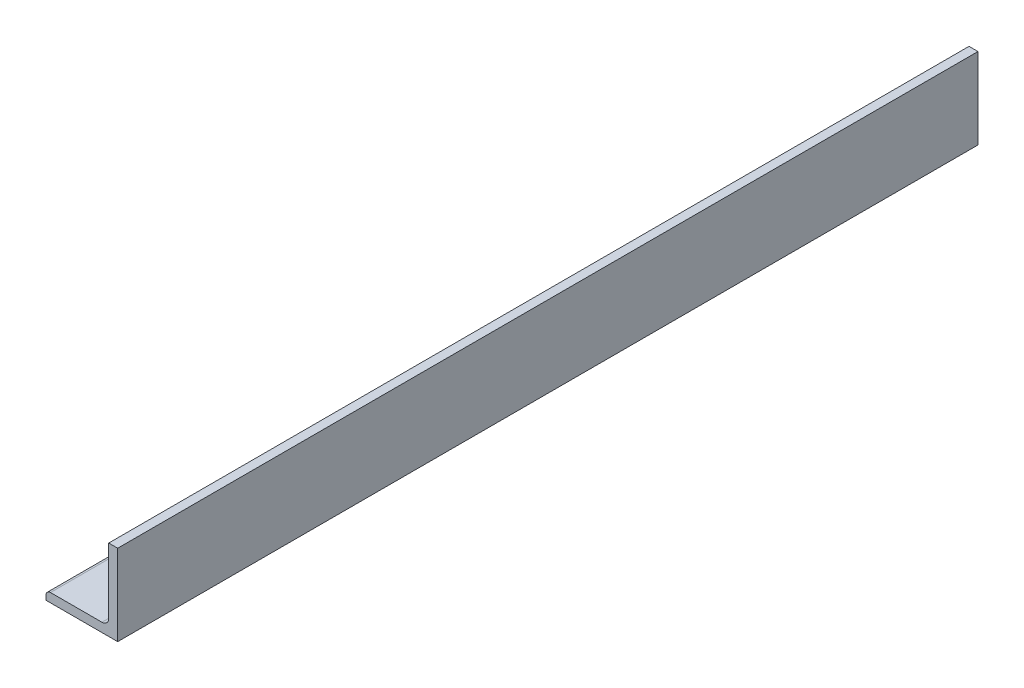
ISO-10303-21;
HEADER;
FILE_DESCRIPTION(('STEP AP214'),'2;1');
FILE_NAME('part.step','',(''),(''),'','','');
FILE_SCHEMA(('AUTOMOTIVE_DESIGN { 1 0 10303 214 1 1 1 1 }'));
ENDSEC;
DATA;
#1=APPLICATION_CONTEXT('core data for automotive mechanical design processes');
#2=APPLICATION_PROTOCOL_DEFINITION('international standard','automotive_design',2000,#1);
#3=PRODUCT_CONTEXT('',#1,'mechanical');
#4=PRODUCT('Part','Part','',(#3));
#5=PRODUCT_RELATED_PRODUCT_CATEGORY('part','',(#4));
#6=PRODUCT_DEFINITION_FORMATION('','',#4);
#7=PRODUCT_DEFINITION_CONTEXT('part definition',#1,'design');
#8=PRODUCT_DEFINITION('design','',#6,#7);
#9=PRODUCT_DEFINITION_SHAPE('','',#8);
#10=(LENGTH_UNIT() NAMED_UNIT(*) SI_UNIT(.MILLI.,.METRE.));
#11=(NAMED_UNIT(*) PLANE_ANGLE_UNIT() SI_UNIT($,.RADIAN.));
#12=(NAMED_UNIT(*) SI_UNIT($,.STERADIAN.) SOLID_ANGLE_UNIT());
#13=UNCERTAINTY_MEASURE_WITH_UNIT(LENGTH_MEASURE(1.E-05),#10,'distance_accuracy_value','');
#14=(GEOMETRIC_REPRESENTATION_CONTEXT(3) GLOBAL_UNCERTAINTY_ASSIGNED_CONTEXT((#13)) GLOBAL_UNIT_ASSIGNED_CONTEXT((#10,
#11,#12)) REPRESENTATION_CONTEXT('',''));
#15=CARTESIAN_POINT('',(0.,0.,0.));
#16=DIRECTION('',(0.,0.,1.));
#17=DIRECTION('',(1.,0.,0.));
#18=AXIS2_PLACEMENT_3D('',#15,#16,#17);
#19=CARTESIAN_POINT('',(-25.4,-34.925,304.8));
#20=DIRECTION('',(1.,0.,0.));
#21=DIRECTION('',(0.,0.,-1.));
#22=AXIS2_PLACEMENT_3D('',#19,#20,#21);
#23=PLANE('',#22);
#24=DIRECTION('',(0.,-1.,0.));
#25=VECTOR('',#24,1.);
#26=CARTESIAN_POINT('',(-25.4,-34.925,-304.8));
#27=LINE('',#26,#25);
#28=CARTESIAN_POINT('',(-25.4,-34.925,-304.8));
#29=VERTEX_POINT('',#28);
#30=CARTESIAN_POINT('',(-25.4,-38.1,-304.8));
#31=VERTEX_POINT('',#30);
#32=EDGE_CURVE('E142',#29,#31,#27,.T.);
#33=ORIENTED_EDGE('',*,*,#32,.T.);
#34=DIRECTION('',(0.,0.,-1.));
#35=VECTOR('',#34,1.);
#36=CARTESIAN_POINT('',(-25.4,-38.1,304.8));
#37=LINE('',#36,#35);
#38=CARTESIAN_POINT('',(-25.4,-38.1,304.8));
#39=VERTEX_POINT('',#38);
#40=EDGE_CURVE('E52',#39,#31,#37,.T.);
#41=ORIENTED_EDGE('',*,*,#40,.F.);
#42=DIRECTION('',(0.,-1.,0.));
#43=VECTOR('',#42,1.);
#44=CARTESIAN_POINT('',(-25.4,-34.925,304.8));
#45=LINE('',#44,#43);
#46=CARTESIAN_POINT('',(-25.4,-34.925,304.8));
#47=VERTEX_POINT('',#46);
#48=EDGE_CURVE('E156',#47,#39,#45,.T.);
#49=ORIENTED_EDGE('',*,*,#48,.F.);
#50=DIRECTION('',(0.,0.,-1.));
#51=VECTOR('',#50,1.);
#52=CARTESIAN_POINT('',(-25.4,-34.925,304.8));
#53=LINE('',#52,#51);
#54=EDGE_CURVE('E138',#47,#29,#53,.T.);
#55=ORIENTED_EDGE('',*,*,#54,.T.);
#56=EDGE_LOOP('',(#33,#41,#49,#55));
#57=FACE_BOUND('',#56,.T.);
#58=ADVANCED_FACE('F45',(#57),#23,.F.);
#59=CARTESIAN_POINT('',(-25.4,-38.1,304.8));
#60=DIRECTION('',(0.,1.,0.));
#61=DIRECTION('',(-1.,0.,0.));
#62=AXIS2_PLACEMENT_3D('',#59,#60,#61);
#63=PLANE('',#62);
#64=DIRECTION('',(1.,0.,0.));
#65=VECTOR('',#64,1.);
#66=CARTESIAN_POINT('',(-25.4,-38.1,-304.8));
#67=LINE('',#66,#65);
#68=CARTESIAN_POINT('',(25.4,-38.1,-304.8));
#69=VERTEX_POINT('',#68);
#70=EDGE_CURVE('E145',#31,#69,#67,.T.);
#71=ORIENTED_EDGE('',*,*,#70,.T.);
#72=DIRECTION('',(0.,0.,-1.));
#73=VECTOR('',#72,1.);
#74=CARTESIAN_POINT('',(25.4,-38.1,304.8));
#75=LINE('',#74,#73);
#76=CARTESIAN_POINT('',(25.4,-38.1,304.8));
#77=VERTEX_POINT('',#76);
#78=EDGE_CURVE('E160',#77,#69,#75,.T.);
#79=ORIENTED_EDGE('',*,*,#78,.F.);
#80=DIRECTION('',(1.,0.,0.));
#81=VECTOR('',#80,1.);
#82=CARTESIAN_POINT('',(-25.4,-38.1,304.8));
#83=LINE('',#82,#81);
#84=EDGE_CURVE('E103',#39,#77,#83,.T.);
#85=ORIENTED_EDGE('',*,*,#84,.F.);
#86=ORIENTED_EDGE('',*,*,#40,.T.);
#87=EDGE_LOOP('',(#71,#79,#85,#86));
#88=FACE_BOUND('',#87,.T.);
#89=ADVANCED_FACE('F163',(#88),#63,.F.);
#90=CARTESIAN_POINT('',(25.4,-38.1,304.8));
#91=DIRECTION('',(-1.,0.,0.));
#92=DIRECTION('',(0.,-1.,0.));
#93=AXIS2_PLACEMENT_3D('',#90,#91,#92);
#94=PLANE('',#93);
#95=DIRECTION('',(0.,1.,0.));
#96=VECTOR('',#95,1.);
#97=CARTESIAN_POINT('',(25.4,-38.1,-304.8));
#98=LINE('',#97,#96);
#99=CARTESIAN_POINT('',(25.4,19.2608858360428,-304.8));
#100=VERTEX_POINT('',#99);
#101=EDGE_CURVE('E147',#69,#100,#98,.T.);
#102=ORIENTED_EDGE('',*,*,#101,.T.);
#103=DIRECTION('',(0.,0.,1.));
#104=VECTOR('',#103,1.);
#105=CARTESIAN_POINT('',(25.4,19.2608858360428,304.8));
#106=LINE('',#105,#104);
#107=CARTESIAN_POINT('',(25.4,19.2608858360428,304.8));
#108=VERTEX_POINT('',#107);
#109=EDGE_CURVE('E58',#100,#108,#106,.T.);
#110=ORIENTED_EDGE('',*,*,#109,.T.);
#111=DIRECTION('',(0.,1.,0.));
#112=VECTOR('',#111,1.);
#113=CARTESIAN_POINT('',(25.4,-38.1,304.8));
#114=LINE('',#113,#112);
#115=EDGE_CURVE('E175',#77,#108,#114,.T.);
#116=ORIENTED_EDGE('',*,*,#115,.F.);
#117=ORIENTED_EDGE('',*,*,#78,.T.);
#118=EDGE_LOOP('',(#102,#110,#116,#117));
#119=FACE_BOUND('',#118,.T.);
#120=ADVANCED_FACE('F172',(#119),#94,.F.);
#121=CARTESIAN_POINT('',(19.05,34.925,304.8));
#122=DIRECTION('',(1.,0.,0.));
#123=DIRECTION('',(0.,1.,0.));
#124=AXIS2_PLACEMENT_3D('',#121,#122,#123);
#125=PLANE('',#124);
#126=DIRECTION('',(0.,-1.,0.));
#127=VECTOR('',#126,1.);
#128=CARTESIAN_POINT('',(19.05,34.925,304.8));
#129=LINE('',#128,#127);
#130=CARTESIAN_POINT('',(19.05,19.2608858360428,304.8));
#131=VERTEX_POINT('',#130);
#132=CARTESIAN_POINT('',(19.05,-26.9748,304.8));
#133=VERTEX_POINT('',#132);
#134=EDGE_CURVE('E121',#131,#133,#129,.T.);
#135=ORIENTED_EDGE('',*,*,#134,.F.);
#136=DIRECTION('',(0.,0.,-1.));
#137=VECTOR('',#136,1.);
#138=CARTESIAN_POINT('',(19.05,19.2608858360428,304.8));
#139=LINE('',#138,#137);
#140=CARTESIAN_POINT('',(19.05,19.2608858360428,-304.8));
#141=VERTEX_POINT('',#140);
#142=EDGE_CURVE('E181',#131,#141,#139,.T.);
#143=ORIENTED_EDGE('',*,*,#142,.T.);
#144=DIRECTION('',(0.,-1.,0.));
#145=VECTOR('',#144,1.);
#146=CARTESIAN_POINT('',(19.05,34.925,-304.8));
#147=LINE('',#146,#145);
#148=CARTESIAN_POINT('',(19.05,-26.9748,-304.8));
#149=VERTEX_POINT('',#148);
#150=EDGE_CURVE('E150',#141,#149,#147,.T.);
#151=ORIENTED_EDGE('',*,*,#150,.T.);
#152=DIRECTION('',(0.,0.,-1.));
#153=VECTOR('',#152,1.);
#154=CARTESIAN_POINT('',(19.05,-26.9748,304.8));
#155=LINE('',#154,#153);
#156=EDGE_CURVE('E133',#133,#149,#155,.T.);
#157=ORIENTED_EDGE('',*,*,#156,.F.);
#158=EDGE_LOOP('',(#135,#143,#151,#157));
#159=FACE_BOUND('',#158,.T.);
#160=ADVANCED_FACE('F190',(#159),#125,.F.);
#161=CARTESIAN_POINT('',(14.2748,-26.9748,304.8));
#162=DIRECTION('',(0.,0.,-1.));
#163=DIRECTION('',(-1.,0.,0.));
#164=AXIS2_PLACEMENT_3D('',#161,#162,#163);
#165=CYLINDRICAL_SURFACE('',#164,4.7752);
#166=CARTESIAN_POINT('',(14.2748,-26.9748,-304.8));
#167=DIRECTION('',(0.,0.,-1.));
#168=DIRECTION('',(-1.,0.,0.));
#169=AXIS2_PLACEMENT_3D('',#166,#167,#168);
#170=CIRCLE('',#169,4.7752);
#171=CARTESIAN_POINT('',(14.2748,-31.75,-304.8));
#172=VERTEX_POINT('',#171);
#173=EDGE_CURVE('E130',#149,#172,#170,.T.);
#174=ORIENTED_EDGE('',*,*,#173,.T.);
#175=DIRECTION('',(0.,0.,-1.));
#176=VECTOR('',#175,1.);
#177=CARTESIAN_POINT('',(14.2748,-31.75,304.8));
#178=LINE('',#177,#176);
#179=CARTESIAN_POINT('',(14.2748,-31.75,304.8));
#180=VERTEX_POINT('',#179);
#181=EDGE_CURVE('E127',#180,#172,#178,.T.);
#182=ORIENTED_EDGE('',*,*,#181,.F.);
#183=CARTESIAN_POINT('',(14.2748,-26.9748,304.8));
#184=DIRECTION('',(0.,0.,-1.));
#185=DIRECTION('',(-1.,0.,0.));
#186=AXIS2_PLACEMENT_3D('',#183,#184,#185);
#187=CIRCLE('',#186,4.7752);
#188=EDGE_CURVE('E112',#133,#180,#187,.T.);
#189=ORIENTED_EDGE('',*,*,#188,.F.);
#190=ORIENTED_EDGE('',*,*,#156,.T.);
#191=EDGE_LOOP('',(#174,#182,#189,#190));
#192=FACE_BOUND('',#191,.T.);
#193=ADVANCED_FACE('F128',(#192),#165,.F.);
#194=CARTESIAN_POINT('',(14.2748,-31.75,304.8));
#195=DIRECTION('',(0.,-1.,0.));
#196=DIRECTION('',(1.,0.,0.));
#197=AXIS2_PLACEMENT_3D('',#194,#195,#196);
#198=PLANE('',#197);
#199=DIRECTION('',(-1.,0.,0.));
#200=VECTOR('',#199,1.);
#201=CARTESIAN_POINT('',(14.2748,-31.75,-304.8));
#202=LINE('',#201,#200);
#203=CARTESIAN_POINT('',(-22.225,-31.75,-304.8));
#204=VERTEX_POINT('',#203);
#205=EDGE_CURVE('E153',#172,#204,#202,.T.);
#206=ORIENTED_EDGE('',*,*,#205,.T.);
#207=DIRECTION('',(0.,0.,-1.));
#208=VECTOR('',#207,1.);
#209=CARTESIAN_POINT('',(-22.225,-31.75,304.8));
#210=LINE('',#209,#208);
#211=CARTESIAN_POINT('',(-22.225,-31.75,304.8));
#212=VERTEX_POINT('',#211);
#213=EDGE_CURVE('E134',#212,#204,#210,.T.);
#214=ORIENTED_EDGE('',*,*,#213,.F.);
#215=DIRECTION('',(-1.,0.,0.));
#216=VECTOR('',#215,1.);
#217=CARTESIAN_POINT('',(14.2748,-31.75,304.8));
#218=LINE('',#217,#216);
#219=EDGE_CURVE('E117',#180,#212,#218,.T.);
#220=ORIENTED_EDGE('',*,*,#219,.F.);
#221=ORIENTED_EDGE('',*,*,#181,.T.);
#222=EDGE_LOOP('',(#206,#214,#220,#221));
#223=FACE_BOUND('',#222,.T.);
#224=ADVANCED_FACE('F136',(#223),#198,.F.);
#225=CARTESIAN_POINT('',(-22.225,-34.925,304.8));
#226=DIRECTION('',(0.,0.,-1.));
#227=DIRECTION('',(-1.,0.,0.));
#228=AXIS2_PLACEMENT_3D('',#225,#226,#227);
#229=CYLINDRICAL_SURFACE('',#228,3.17499999999999);
#230=CARTESIAN_POINT('',(-22.225,-34.925,-304.8));
#231=DIRECTION('',(0.,0.,1.));
#232=DIRECTION('',(-1.,0.,0.));
#233=AXIS2_PLACEMENT_3D('',#230,#231,#232);
#234=CIRCLE('',#233,3.17499999999999);
#235=EDGE_CURVE('E94',#204,#29,#234,.T.);
#236=ORIENTED_EDGE('',*,*,#235,.T.);
#237=ORIENTED_EDGE('',*,*,#54,.F.);
#238=CARTESIAN_POINT('',(-22.225,-34.925,304.8));
#239=DIRECTION('',(0.,0.,1.));
#240=DIRECTION('',(-1.,0.,0.));
#241=AXIS2_PLACEMENT_3D('',#238,#239,#240);
#242=CIRCLE('',#241,3.17499999999999);
#243=EDGE_CURVE('E67',#212,#47,#242,.T.);
#244=ORIENTED_EDGE('',*,*,#243,.F.);
#245=ORIENTED_EDGE('',*,*,#213,.T.);
#246=EDGE_LOOP('',(#236,#237,#244,#245));
#247=FACE_BOUND('',#246,.T.);
#248=ADVANCED_FACE('F191',(#247),#229,.T.);
#249=CARTESIAN_POINT('',(22.225,34.925,304.8));
#250=DIRECTION('',(0.,0.,-1.));
#251=DIRECTION('',(-1.,0.,0.));
#252=AXIS2_PLACEMENT_3D('',#249,#250,#251);
#253=PLANE('',#252);
#254=ORIENTED_EDGE('',*,*,#115,.T.);
#255=DIRECTION('',(1.,0.,0.));
#256=VECTOR('',#255,1.);
#257=CARTESIAN_POINT('',(8.76887247803841,19.2608858360428,304.8));
#258=LINE('',#257,#256);
#259=EDGE_CURVE('E184',#131,#108,#258,.T.);
#260=ORIENTED_EDGE('',*,*,#259,.F.);
#261=ORIENTED_EDGE('',*,*,#134,.T.);
#262=ORIENTED_EDGE('',*,*,#188,.T.);
#263=ORIENTED_EDGE('',*,*,#219,.T.);
#264=ORIENTED_EDGE('',*,*,#243,.T.);
#265=ORIENTED_EDGE('',*,*,#48,.T.);
#266=ORIENTED_EDGE('',*,*,#84,.T.);
#267=EDGE_LOOP('',(#254,#260,#261,#262,#263,#264,#265,#266));
#268=FACE_BOUND('',#267,.T.);
#269=ADVANCED_FACE('F115',(#268),#253,.F.);
#270=CARTESIAN_POINT('',(22.225,34.925,-304.8));
#271=DIRECTION('',(0.,0.,-1.));
#272=DIRECTION('',(-1.,0.,0.));
#273=AXIS2_PLACEMENT_3D('',#270,#271,#272);
#274=PLANE('',#273);
#275=DIRECTION('',(-1.,0.,0.));
#276=VECTOR('',#275,1.);
#277=CARTESIAN_POINT('',(22.225,19.2608858360428,-304.8));
#278=LINE('',#277,#276);
#279=EDGE_CURVE('E11',#100,#141,#278,.T.);
#280=ORIENTED_EDGE('',*,*,#279,.F.);
#281=ORIENTED_EDGE('',*,*,#101,.F.);
#282=ORIENTED_EDGE('',*,*,#70,.F.);
#283=ORIENTED_EDGE('',*,*,#32,.F.);
#284=ORIENTED_EDGE('',*,*,#235,.F.);
#285=ORIENTED_EDGE('',*,*,#205,.F.);
#286=ORIENTED_EDGE('',*,*,#173,.F.);
#287=ORIENTED_EDGE('',*,*,#150,.F.);
#288=EDGE_LOOP('',(#280,#281,#282,#283,#284,#285,#286,#287));
#289=FACE_BOUND('',#288,.T.);
#290=ADVANCED_FACE('F168',(#289),#274,.T.);
#291=CARTESIAN_POINT('',(8.76887247803841,19.2608858360428,-304.8));
#292=DIRECTION('',(0.,-1.,0.));
#293=DIRECTION('',(0.,0.,-1.));
#294=AXIS2_PLACEMENT_3D('',#291,#292,#293);
#295=PLANE('',#294);
#296=ORIENTED_EDGE('',*,*,#279,.T.);
#297=ORIENTED_EDGE('',*,*,#142,.F.);
#298=ORIENTED_EDGE('',*,*,#259,.T.);
#299=ORIENTED_EDGE('',*,*,#109,.F.);
#300=EDGE_LOOP('',(#296,#297,#298,#299));
#301=FACE_BOUND('',#300,.T.);
#302=ADVANCED_FACE('F186',(#301),#295,.F.);
#303=CLOSED_SHELL('',(#58,#89,#120,#160,#193,#224,#248,#269,#290,#302));
#304=MANIFOLD_SOLID_BREP('B2',#303);
#305=ADVANCED_BREP_SHAPE_REPRESENTATION('',(#18,#304),#14);
#306=SHAPE_DEFINITION_REPRESENTATION(#9,#305);
ENDSEC;
END-ISO-10303-21;
